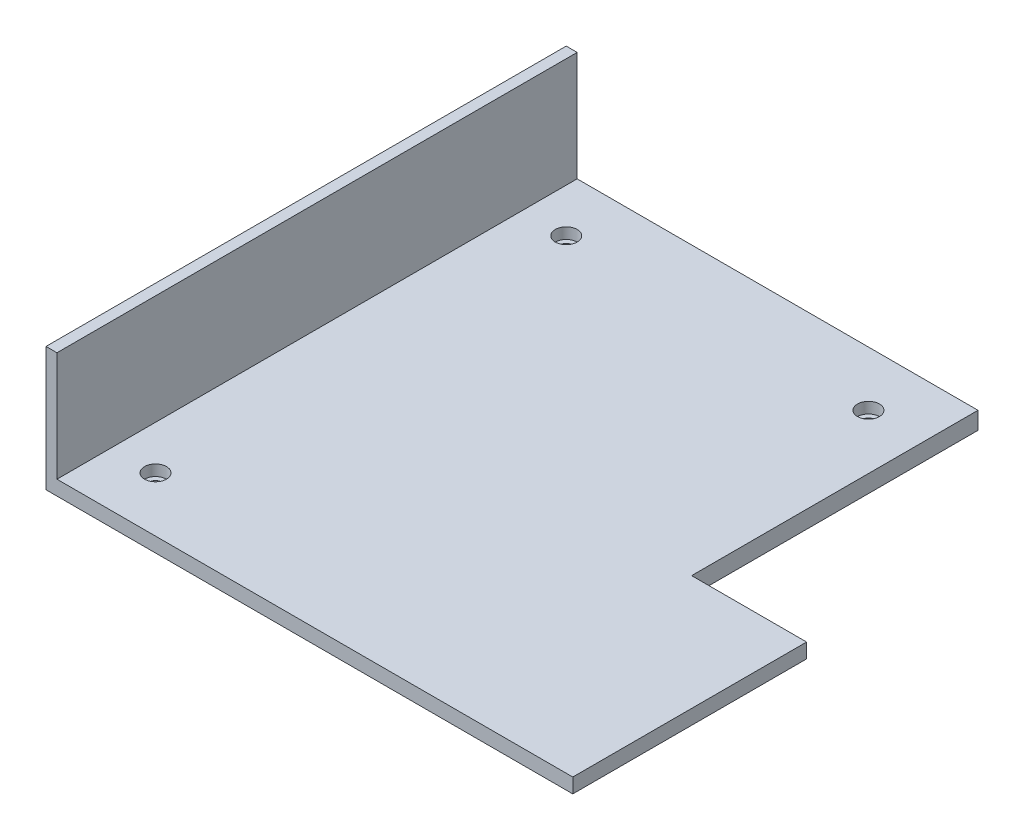
ISO-10303-21;
HEADER;
FILE_DESCRIPTION(('STEP AP214'),'2;1');
FILE_NAME('part.step','',(''),(''),'','','');
FILE_SCHEMA(('AUTOMOTIVE_DESIGN { 1 0 10303 214 1 1 1 1 }'));
ENDSEC;
DATA;
#1=APPLICATION_CONTEXT('core data for automotive mechanical design processes');
#2=APPLICATION_PROTOCOL_DEFINITION('international standard','automotive_design',2000,#1);
#3=PRODUCT_CONTEXT('',#1,'mechanical');
#4=PRODUCT('Part','Part','',(#3));
#5=PRODUCT_RELATED_PRODUCT_CATEGORY('part','',(#4));
#6=PRODUCT_DEFINITION_FORMATION('','',#4);
#7=PRODUCT_DEFINITION_CONTEXT('part definition',#1,'design');
#8=PRODUCT_DEFINITION('design','',#6,#7);
#9=PRODUCT_DEFINITION_SHAPE('','',#8);
#10=(LENGTH_UNIT() NAMED_UNIT(*) SI_UNIT(.MILLI.,.METRE.));
#11=(NAMED_UNIT(*) PLANE_ANGLE_UNIT() SI_UNIT($,.RADIAN.));
#12=(NAMED_UNIT(*) SI_UNIT($,.STERADIAN.) SOLID_ANGLE_UNIT());
#13=UNCERTAINTY_MEASURE_WITH_UNIT(LENGTH_MEASURE(1.E-05),#10,'distance_accuracy_value','');
#14=(GEOMETRIC_REPRESENTATION_CONTEXT(3) GLOBAL_UNCERTAINTY_ASSIGNED_CONTEXT((#13)) GLOBAL_UNIT_ASSIGNED_CONTEXT((#10,
#11,#12)) REPRESENTATION_CONTEXT('',''));
#15=CARTESIAN_POINT('',(0.,0.,0.));
#16=DIRECTION('',(0.,0.,1.));
#17=DIRECTION('',(1.,0.,0.));
#18=AXIS2_PLACEMENT_3D('',#15,#16,#17);
#19=CARTESIAN_POINT('',(96.2,6.35,-95.));
#20=DIRECTION('',(-1.,0.,0.));
#21=DIRECTION('',(0.,0.,1.));
#22=AXIS2_PLACEMENT_3D('',#19,#20,#21);
#23=PLANE('',#22);
#24=DIRECTION('',(0.,-1.,0.));
#25=VECTOR('',#24,1.);
#26=CARTESIAN_POINT('',(96.2,6.35,95.));
#27=LINE('',#26,#25);
#28=CARTESIAN_POINT('',(96.2,6.35,95.));
#29=VERTEX_POINT('',#28);
#30=CARTESIAN_POINT('',(96.2,1.,95.));
#31=VERTEX_POINT('',#30);
#32=EDGE_CURVE('E159',#29,#31,#27,.T.);
#33=ORIENTED_EDGE('',*,*,#32,.T.);
#34=DIRECTION('',(0.,0.,-1.));
#35=VECTOR('',#34,1.);
#36=CARTESIAN_POINT('',(96.2,1.,-95.));
#37=LINE('',#36,#35);
#38=CARTESIAN_POINT('',(96.2,1.,9.60000000000001));
#39=VERTEX_POINT('',#38);
#40=EDGE_CURVE('E181',#31,#39,#37,.T.);
#41=ORIENTED_EDGE('',*,*,#40,.T.);
#42=DIRECTION('',(0.,1.,0.));
#43=VECTOR('',#42,1.);
#44=CARTESIAN_POINT('',(96.2,-0.00100000000000013,9.60000000000001));
#45=LINE('',#44,#43);
#46=CARTESIAN_POINT('',(96.2,6.35,9.60000000000001));
#47=VERTEX_POINT('',#46);
#48=EDGE_CURVE('E213',#39,#47,#45,.T.);
#49=ORIENTED_EDGE('',*,*,#48,.T.);
#50=DIRECTION('',(0.,0.,-1.));
#51=VECTOR('',#50,1.);
#52=CARTESIAN_POINT('',(96.2,6.35,-95.));
#53=LINE('',#52,#51);
#54=EDGE_CURVE('E155',#29,#47,#53,.T.);
#55=ORIENTED_EDGE('',*,*,#54,.F.);
#56=EDGE_LOOP('',(#33,#41,#49,#55));
#57=FACE_BOUND('',#56,.T.);
#58=ADVANCED_FACE('F47',(#57),#23,.F.);
#59=CARTESIAN_POINT('',(-96.2,6.35,-95.));
#60=DIRECTION('',(0.,0.,1.));
#61=DIRECTION('',(1.,0.,0.));
#62=AXIS2_PLACEMENT_3D('',#59,#60,#61);
#63=PLANE('',#62);
#64=DIRECTION('',(-1.,0.,0.));
#65=VECTOR('',#64,1.);
#66=CARTESIAN_POINT('',(-96.2,6.35,-95.));
#67=LINE('',#66,#65);
#68=CARTESIAN_POINT('',(54.2,6.35,-95.));
#69=VERTEX_POINT('',#68);
#70=CARTESIAN_POINT('',(-92.2,6.35,-95.));
#71=VERTEX_POINT('',#70);
#72=EDGE_CURVE('E141',#69,#71,#67,.T.);
#73=ORIENTED_EDGE('',*,*,#72,.F.);
#74=DIRECTION('',(0.,1.,0.));
#75=VECTOR('',#74,1.);
#76=CARTESIAN_POINT('',(54.2,-0.00100000000000013,-95.));
#77=LINE('',#76,#75);
#78=CARTESIAN_POINT('',(54.2,0.,-95.));
#79=VERTEX_POINT('',#78);
#80=EDGE_CURVE('E124',#79,#69,#77,.T.);
#81=ORIENTED_EDGE('',*,*,#80,.F.);
#82=DIRECTION('',(-1.,0.,0.));
#83=VECTOR('',#82,1.);
#84=CARTESIAN_POINT('',(-96.2,0.,-95.));
#85=LINE('',#84,#83);
#86=CARTESIAN_POINT('',(-96.2,0.,-95.));
#87=VERTEX_POINT('',#86);
#88=EDGE_CURVE('E165',#79,#87,#85,.T.);
#89=ORIENTED_EDGE('',*,*,#88,.T.);
#90=DIRECTION('',(0.,-1.,0.));
#91=VECTOR('',#90,1.);
#92=CARTESIAN_POINT('',(-96.2,6.35,-95.));
#93=LINE('',#92,#91);
#94=CARTESIAN_POINT('',(-96.2,46.35,-95.));
#95=VERTEX_POINT('',#94);
#96=EDGE_CURVE('E177',#95,#87,#93,.T.);
#97=ORIENTED_EDGE('',*,*,#96,.F.);
#98=DIRECTION('',(-1.,0.,0.));
#99=VECTOR('',#98,1.);
#100=CARTESIAN_POINT('',(-92.2,46.35,-95.));
#101=LINE('',#100,#99);
#102=CARTESIAN_POINT('',(-92.2,46.35,-95.));
#103=VERTEX_POINT('',#102);
#104=EDGE_CURVE('E229',#103,#95,#101,.T.);
#105=ORIENTED_EDGE('',*,*,#104,.F.);
#106=DIRECTION('',(0.,-1.,0.));
#107=VECTOR('',#106,1.);
#108=CARTESIAN_POINT('',(-92.2,46.35,-95.));
#109=LINE('',#108,#107);
#110=EDGE_CURVE('E152',#103,#71,#109,.T.);
#111=ORIENTED_EDGE('',*,*,#110,.T.);
#112=EDGE_LOOP('',(#73,#81,#89,#97,#105,#111));
#113=FACE_BOUND('',#112,.T.);
#114=ADVANCED_FACE('F149',(#113),#63,.F.);
#115=CARTESIAN_POINT('',(-96.2,6.35,-95.));
#116=DIRECTION('',(1.,0.,0.));
#117=DIRECTION('',(0.,0.,-1.));
#118=AXIS2_PLACEMENT_3D('',#115,#116,#117);
#119=PLANE('',#118);
#120=DIRECTION('',(0.,0.,1.));
#121=VECTOR('',#120,1.);
#122=CARTESIAN_POINT('',(-96.2,0.,-95.));
#123=LINE('',#122,#121);
#124=CARTESIAN_POINT('',(-96.2,0.,94.));
#125=VERTEX_POINT('',#124);
#126=EDGE_CURVE('E161',#87,#125,#123,.T.);
#127=ORIENTED_EDGE('',*,*,#126,.T.);
#128=DIRECTION('',(0.,-0.707106781186548,-0.707106781186548));
#129=VECTOR('',#128,1.);
#130=CARTESIAN_POINT('',(-96.2,1.,95.));
#131=LINE('',#130,#129);
#132=CARTESIAN_POINT('',(-96.2,1.,95.));
#133=VERTEX_POINT('',#132);
#134=EDGE_CURVE('E11',#125,#133,#131,.F.);
#135=ORIENTED_EDGE('',*,*,#134,.T.);
#136=DIRECTION('',(0.,-1.,0.));
#137=VECTOR('',#136,1.);
#138=CARTESIAN_POINT('',(-96.2,6.35,95.));
#139=LINE('',#138,#137);
#140=CARTESIAN_POINT('',(-96.2,46.35,95.));
#141=VERTEX_POINT('',#140);
#142=EDGE_CURVE('E174',#141,#133,#139,.T.);
#143=ORIENTED_EDGE('',*,*,#142,.F.);
#144=DIRECTION('',(0.,0.,1.));
#145=VECTOR('',#144,1.);
#146=CARTESIAN_POINT('',(-96.2,46.35,-95.));
#147=LINE('',#146,#145);
#148=EDGE_CURVE('E233',#95,#141,#147,.T.);
#149=ORIENTED_EDGE('',*,*,#148,.F.);
#150=ORIENTED_EDGE('',*,*,#96,.T.);
#151=EDGE_LOOP('',(#127,#135,#143,#149,#150));
#152=FACE_BOUND('',#151,.T.);
#153=ADVANCED_FACE('F255',(#152),#119,.F.);
#154=CARTESIAN_POINT('',(-96.2,6.35,95.));
#155=DIRECTION('',(0.,0.,-1.));
#156=DIRECTION('',(-1.,0.,0.));
#157=AXIS2_PLACEMENT_3D('',#154,#155,#156);
#158=PLANE('',#157);
#159=ORIENTED_EDGE('',*,*,#142,.T.);
#160=DIRECTION('',(1.,0.,0.));
#161=VECTOR('',#160,1.);
#162=CARTESIAN_POINT('',(-96.2,1.,95.));
#163=LINE('',#162,#161);
#164=EDGE_CURVE('E58',#133,#31,#163,.T.);
#165=ORIENTED_EDGE('',*,*,#164,.T.);
#166=ORIENTED_EDGE('',*,*,#32,.F.);
#167=DIRECTION('',(1.,0.,0.));
#168=VECTOR('',#167,1.);
#169=CARTESIAN_POINT('',(-96.2,6.35,95.));
#170=LINE('',#169,#168);
#171=CARTESIAN_POINT('',(-92.2,6.35,95.));
#172=VERTEX_POINT('',#171);
#173=EDGE_CURVE('E154',#172,#29,#170,.T.);
#174=ORIENTED_EDGE('',*,*,#173,.F.);
#175=DIRECTION('',(0.,-1.,0.));
#176=VECTOR('',#175,1.);
#177=CARTESIAN_POINT('',(-92.2,46.35,95.));
#178=LINE('',#177,#176);
#179=CARTESIAN_POINT('',(-92.2,46.35,95.));
#180=VERTEX_POINT('',#179);
#181=EDGE_CURVE('E168',#180,#172,#178,.T.);
#182=ORIENTED_EDGE('',*,*,#181,.F.);
#183=DIRECTION('',(1.,0.,0.));
#184=VECTOR('',#183,1.);
#185=CARTESIAN_POINT('',(-92.2,46.35,95.));
#186=LINE('',#185,#184);
#187=EDGE_CURVE('E237',#141,#180,#186,.T.);
#188=ORIENTED_EDGE('',*,*,#187,.F.);
#189=EDGE_LOOP('',(#159,#165,#166,#174,#182,#188));
#190=FACE_BOUND('',#189,.T.);
#191=ADVANCED_FACE('F197',(#190),#158,.F.);
#192=CARTESIAN_POINT('',(0.,6.35,0.));
#193=DIRECTION('',(0.,1.,0.));
#194=DIRECTION('',(0.,0.,1.));
#195=AXIS2_PLACEMENT_3D('',#192,#193,#194);
#196=PLANE('',#195);
#197=CARTESIAN_POINT('',(-76.2,6.35,-75.));
#198=DIRECTION('',(0.,1.,0.));
#199=DIRECTION('',(0.,0.,1.));
#200=AXIS2_PLACEMENT_3D('',#197,#198,#199);
#201=CIRCLE('',#200,3.99999999999999);
#202=CARTESIAN_POINT('',(-76.2,6.35,-71.));
#203=VERTEX_POINT('',#202);
#204=EDGE_CURVE('E209',#203,#203,#201,.T.);
#205=ORIENTED_EDGE('',*,*,#204,.F.);
#206=EDGE_LOOP('',(#205));
#207=FACE_BOUND('',#206,.T.);
#208=CARTESIAN_POINT('',(-76.2,6.35,75.));
#209=DIRECTION('',(0.,1.,0.));
#210=DIRECTION('',(0.,0.,1.));
#211=AXIS2_PLACEMENT_3D('',#208,#209,#210);
#212=CIRCLE('',#211,3.99999999999999);
#213=CARTESIAN_POINT('',(-76.2,6.35,79.));
#214=VERTEX_POINT('',#213);
#215=EDGE_CURVE('E368',#214,#214,#212,.T.);
#216=ORIENTED_EDGE('',*,*,#215,.F.);
#217=EDGE_LOOP('',(#216));
#218=FACE_BOUND('',#217,.T.);
#219=CARTESIAN_POINT('',(34.2,6.35,-75.));
#220=DIRECTION('',(0.,1.,0.));
#221=DIRECTION('',(0.,0.,1.));
#222=AXIS2_PLACEMENT_3D('',#219,#220,#221);
#223=CIRCLE('',#222,3.99999999999999);
#224=CARTESIAN_POINT('',(34.2,6.35,-71.));
#225=VERTEX_POINT('',#224);
#226=EDGE_CURVE('E354',#225,#225,#223,.T.);
#227=ORIENTED_EDGE('',*,*,#226,.F.);
#228=EDGE_LOOP('',(#227));
#229=FACE_BOUND('',#228,.T.);
#230=DIRECTION('',(1.,0.,0.));
#231=VECTOR('',#230,1.);
#232=CARTESIAN_POINT('',(96.2,6.35,9.60000000000001));
#233=LINE('',#232,#231);
#234=CARTESIAN_POINT('',(54.2,6.35,9.60000000000002));
#235=VERTEX_POINT('',#234);
#236=EDGE_CURVE('E137',#235,#47,#233,.T.);
#237=ORIENTED_EDGE('',*,*,#236,.F.);
#238=DIRECTION('',(0.,0.,1.));
#239=VECTOR('',#238,1.);
#240=CARTESIAN_POINT('',(54.2,6.35,-95.));
#241=LINE('',#240,#239);
#242=EDGE_CURVE('E128',#69,#235,#241,.T.);
#243=ORIENTED_EDGE('',*,*,#242,.F.);
#244=ORIENTED_EDGE('',*,*,#72,.T.);
#245=DIRECTION('',(0.,0.,-1.));
#246=VECTOR('',#245,1.);
#247=CARTESIAN_POINT('',(-92.2,6.35,-91.));
#248=LINE('',#247,#246);
#249=EDGE_CURVE('E226',#172,#71,#248,.T.);
#250=ORIENTED_EDGE('',*,*,#249,.F.);
#251=ORIENTED_EDGE('',*,*,#173,.T.);
#252=ORIENTED_EDGE('',*,*,#54,.T.);
#253=EDGE_LOOP('',(#237,#243,#244,#250,#251,#252));
#254=FACE_BOUND('',#253,.T.);
#255=ADVANCED_FACE('F140',(#207,#218,#229,#254),#196,.T.);
#256=CARTESIAN_POINT('',(0.,0.,0.));
#257=DIRECTION('',(0.,1.,0.));
#258=DIRECTION('',(0.,0.,1.));
#259=AXIS2_PLACEMENT_3D('',#256,#257,#258);
#260=PLANE('',#259);
#261=CARTESIAN_POINT('',(-76.2,0.,-75.));
#262=DIRECTION('',(0.,1.,0.));
#263=DIRECTION('',(0.,0.,1.));
#264=AXIS2_PLACEMENT_3D('',#261,#262,#263);
#265=CIRCLE('',#264,2.25000000000001);
#266=CARTESIAN_POINT('',(-76.2,0.,-72.75));
#267=VERTEX_POINT('',#266);
#268=EDGE_CURVE('E337',#267,#267,#265,.T.);
#269=ORIENTED_EDGE('',*,*,#268,.T.);
#270=EDGE_LOOP('',(#269));
#271=FACE_BOUND('',#270,.T.);
#272=CARTESIAN_POINT('',(-76.2,0.,75.));
#273=DIRECTION('',(0.,1.,0.));
#274=DIRECTION('',(0.,0.,1.));
#275=AXIS2_PLACEMENT_3D('',#272,#273,#274);
#276=CIRCLE('',#275,2.25000000000001);
#277=CARTESIAN_POINT('',(-76.2,0.,77.25));
#278=VERTEX_POINT('',#277);
#279=EDGE_CURVE('E341',#278,#278,#276,.T.);
#280=ORIENTED_EDGE('',*,*,#279,.T.);
#281=EDGE_LOOP('',(#280));
#282=FACE_BOUND('',#281,.T.);
#283=CARTESIAN_POINT('',(34.2,0.,-75.));
#284=DIRECTION('',(0.,1.,0.));
#285=DIRECTION('',(0.,0.,1.));
#286=AXIS2_PLACEMENT_3D('',#283,#284,#285);
#287=CIRCLE('',#286,2.25000000000001);
#288=CARTESIAN_POINT('',(34.2,0.,-72.75));
#289=VERTEX_POINT('',#288);
#290=EDGE_CURVE('E218',#289,#289,#287,.T.);
#291=ORIENTED_EDGE('',*,*,#290,.T.);
#292=EDGE_LOOP('',(#291));
#293=FACE_BOUND('',#292,.T.);
#294=DIRECTION('',(-1.,0.,0.));
#295=VECTOR('',#294,1.);
#296=CARTESIAN_POINT('',(96.2,0.,9.60000000000001));
#297=LINE('',#296,#295);
#298=CARTESIAN_POINT('',(95.2,0.,9.60000000000001));
#299=VERTEX_POINT('',#298);
#300=CARTESIAN_POINT('',(54.2,0.,9.60000000000002));
#301=VERTEX_POINT('',#300);
#302=EDGE_CURVE('E146',#299,#301,#297,.T.);
#303=ORIENTED_EDGE('',*,*,#302,.F.);
#304=DIRECTION('',(0.,0.,1.));
#305=VECTOR('',#304,1.);
#306=CARTESIAN_POINT('',(95.2,0.,0.));
#307=LINE('',#306,#305);
#308=CARTESIAN_POINT('',(95.2,0.,94.));
#309=VERTEX_POINT('',#308);
#310=EDGE_CURVE('E71',#299,#309,#307,.T.);
#311=ORIENTED_EDGE('',*,*,#310,.T.);
#312=DIRECTION('',(-1.,0.,0.));
#313=VECTOR('',#312,1.);
#314=CARTESIAN_POINT('',(0.,0.,94.));
#315=LINE('',#314,#313);
#316=EDGE_CURVE('E188',#309,#125,#315,.T.);
#317=ORIENTED_EDGE('',*,*,#316,.T.);
#318=ORIENTED_EDGE('',*,*,#126,.F.);
#319=ORIENTED_EDGE('',*,*,#88,.F.);
#320=DIRECTION('',(0.,0.,-1.));
#321=VECTOR('',#320,1.);
#322=CARTESIAN_POINT('',(54.2,0.,-95.));
#323=LINE('',#322,#321);
#324=EDGE_CURVE('E131',#301,#79,#323,.T.);
#325=ORIENTED_EDGE('',*,*,#324,.F.);
#326=EDGE_LOOP('',(#303,#311,#317,#318,#319,#325));
#327=FACE_BOUND('',#326,.T.);
#328=ADVANCED_FACE('F214',(#271,#282,#293,#327),#260,.F.);
#329=CARTESIAN_POINT('',(-92.2,46.35,-91.));
#330=DIRECTION('',(-1.,0.,0.));
#331=DIRECTION('',(0.,0.,1.));
#332=AXIS2_PLACEMENT_3D('',#329,#330,#331);
#333=PLANE('',#332);
#334=ORIENTED_EDGE('',*,*,#249,.T.);
#335=ORIENTED_EDGE('',*,*,#110,.F.);
#336=DIRECTION('',(0.,0.,-1.));
#337=VECTOR('',#336,1.);
#338=CARTESIAN_POINT('',(-92.2,46.35,91.));
#339=LINE('',#338,#337);
#340=EDGE_CURVE('E240',#180,#103,#339,.T.);
#341=ORIENTED_EDGE('',*,*,#340,.F.);
#342=ORIENTED_EDGE('',*,*,#181,.T.);
#343=EDGE_LOOP('',(#334,#335,#341,#342));
#344=FACE_BOUND('',#343,.T.);
#345=ADVANCED_FACE('F251',(#344),#333,.F.);
#346=CARTESIAN_POINT('',(0.,46.35,0.));
#347=DIRECTION('',(0.,1.,0.));
#348=DIRECTION('',(0.,0.,1.));
#349=AXIS2_PLACEMENT_3D('',#346,#347,#348);
#350=PLANE('',#349);
#351=ORIENTED_EDGE('',*,*,#104,.T.);
#352=ORIENTED_EDGE('',*,*,#148,.T.);
#353=ORIENTED_EDGE('',*,*,#187,.T.);
#354=ORIENTED_EDGE('',*,*,#340,.T.);
#355=EDGE_LOOP('',(#351,#352,#353,#354));
#356=FACE_BOUND('',#355,.T.);
#357=ADVANCED_FACE('F253',(#356),#350,.T.);
#358=CARTESIAN_POINT('',(96.2,-0.00100000000000013,9.60000000000001));
#359=DIRECTION('',(0.,0.,1.));
#360=DIRECTION('',(1.,0.,0.));
#361=AXIS2_PLACEMENT_3D('',#358,#359,#360);
#362=PLANE('',#361);
#363=ORIENTED_EDGE('',*,*,#48,.F.);
#364=DIRECTION('',(0.707106781186548,0.707106781186548,0.));
#365=VECTOR('',#364,1.);
#366=CARTESIAN_POINT('',(96.2,1.,9.60000000000001));
#367=LINE('',#366,#365);
#368=EDGE_CURVE('E185',#39,#299,#367,.F.);
#369=ORIENTED_EDGE('',*,*,#368,.T.);
#370=ORIENTED_EDGE('',*,*,#302,.T.);
#371=DIRECTION('',(0.,1.,0.));
#372=VECTOR('',#371,1.);
#373=CARTESIAN_POINT('',(54.2,-0.00100000000000013,9.60000000000002));
#374=LINE('',#373,#372);
#375=EDGE_CURVE('E136',#301,#235,#374,.T.);
#376=ORIENTED_EDGE('',*,*,#375,.T.);
#377=ORIENTED_EDGE('',*,*,#236,.T.);
#378=EDGE_LOOP('',(#363,#369,#370,#376,#377));
#379=FACE_BOUND('',#378,.T.);
#380=ADVANCED_FACE('F212',(#379),#362,.F.);
#381=CARTESIAN_POINT('',(54.2,-0.00100000000000013,-95.));
#382=DIRECTION('',(-1.,0.,0.));
#383=DIRECTION('',(0.,0.,1.));
#384=AXIS2_PLACEMENT_3D('',#381,#382,#383);
#385=PLANE('',#384);
#386=ORIENTED_EDGE('',*,*,#324,.T.);
#387=ORIENTED_EDGE('',*,*,#80,.T.);
#388=ORIENTED_EDGE('',*,*,#242,.T.);
#389=ORIENTED_EDGE('',*,*,#375,.F.);
#390=EDGE_LOOP('',(#386,#387,#388,#389));
#391=FACE_BOUND('',#390,.T.);
#392=ADVANCED_FACE('F126',(#391),#385,.F.);
#393=CARTESIAN_POINT('',(34.2,6.35,-75.));
#394=DIRECTION('',(0.,1.,0.));
#395=DIRECTION('',(0.,0.,1.));
#396=AXIS2_PLACEMENT_3D('',#393,#394,#395);
#397=CYLINDRICAL_SURFACE('',#396,2.25000000000001);
#398=ORIENTED_EDGE('',*,*,#290,.F.);
#399=EDGE_LOOP('',(#398));
#400=FACE_BOUND('',#399,.T.);
#401=CARTESIAN_POINT('',(34.2,2.35,-75.));
#402=DIRECTION('',(0.,1.,0.));
#403=DIRECTION('',(0.,0.,1.));
#404=AXIS2_PLACEMENT_3D('',#401,#402,#403);
#405=CIRCLE('',#404,2.25000000000002);
#406=CARTESIAN_POINT('',(34.2,2.35,-72.75));
#407=VERTEX_POINT('',#406);
#408=EDGE_CURVE('E345',#407,#407,#405,.T.);
#409=ORIENTED_EDGE('',*,*,#408,.T.);
#410=EDGE_LOOP('',(#409));
#411=FACE_BOUND('',#410,.T.);
#412=ADVANCED_FACE('F315',(#400,#411),#397,.F.);
#413=CARTESIAN_POINT('',(36.45,2.35,-75.));
#414=DIRECTION('',(0.,-1.,0.));
#415=DIRECTION('',(0.,0.,-1.));
#416=AXIS2_PLACEMENT_3D('',#413,#414,#415);
#417=PLANE('',#416);
#418=ORIENTED_EDGE('',*,*,#408,.F.);
#419=EDGE_LOOP('',(#418));
#420=FACE_BOUND('',#419,.T.);
#421=CARTESIAN_POINT('',(34.2,2.35,-75.));
#422=DIRECTION('',(0.,1.,0.));
#423=DIRECTION('',(0.,0.,1.));
#424=AXIS2_PLACEMENT_3D('',#421,#422,#423);
#425=CIRCLE('',#424,3.99999999999999);
#426=CARTESIAN_POINT('',(34.2,2.35,-71.));
#427=VERTEX_POINT('',#426);
#428=EDGE_CURVE('E348',#427,#427,#425,.T.);
#429=ORIENTED_EDGE('',*,*,#428,.T.);
#430=EDGE_LOOP('',(#429));
#431=FACE_BOUND('',#430,.T.);
#432=ADVANCED_FACE('F311',(#420,#431),#417,.F.);
#433=CARTESIAN_POINT('',(34.2,6.35,-75.));
#434=DIRECTION('',(0.,1.,0.));
#435=DIRECTION('',(0.,0.,1.));
#436=AXIS2_PLACEMENT_3D('',#433,#434,#435);
#437=CYLINDRICAL_SURFACE('',#436,3.99999999999999);
#438=ORIENTED_EDGE('',*,*,#428,.F.);
#439=EDGE_LOOP('',(#438));
#440=FACE_BOUND('',#439,.T.);
#441=ORIENTED_EDGE('',*,*,#226,.T.);
#442=EDGE_LOOP('',(#441));
#443=FACE_BOUND('',#442,.T.);
#444=ADVANCED_FACE('F307',(#440,#443),#437,.F.);
#445=CARTESIAN_POINT('',(-76.2,6.35,75.));
#446=DIRECTION('',(0.,1.,0.));
#447=DIRECTION('',(0.,0.,1.));
#448=AXIS2_PLACEMENT_3D('',#445,#446,#447);
#449=CYLINDRICAL_SURFACE('',#448,2.25000000000001);
#450=ORIENTED_EDGE('',*,*,#279,.F.);
#451=EDGE_LOOP('',(#450));
#452=FACE_BOUND('',#451,.T.);
#453=CARTESIAN_POINT('',(-76.2,2.35,75.));
#454=DIRECTION('',(0.,1.,0.));
#455=DIRECTION('',(0.,0.,1.));
#456=AXIS2_PLACEMENT_3D('',#453,#454,#455);
#457=CIRCLE('',#456,2.25000000000002);
#458=CARTESIAN_POINT('',(-76.2,2.35,77.25));
#459=VERTEX_POINT('',#458);
#460=EDGE_CURVE('E360',#459,#459,#457,.T.);
#461=ORIENTED_EDGE('',*,*,#460,.T.);
#462=EDGE_LOOP('',(#461));
#463=FACE_BOUND('',#462,.T.);
#464=ADVANCED_FACE('F303',(#452,#463),#449,.F.);
#465=CARTESIAN_POINT('',(-73.95,2.35,75.));
#466=DIRECTION('',(0.,-1.,0.));
#467=DIRECTION('',(0.,0.,-1.));
#468=AXIS2_PLACEMENT_3D('',#465,#466,#467);
#469=PLANE('',#468);
#470=ORIENTED_EDGE('',*,*,#460,.F.);
#471=EDGE_LOOP('',(#470));
#472=FACE_BOUND('',#471,.T.);
#473=CARTESIAN_POINT('',(-76.2,2.35,75.));
#474=DIRECTION('',(0.,1.,0.));
#475=DIRECTION('',(0.,0.,1.));
#476=AXIS2_PLACEMENT_3D('',#473,#474,#475);
#477=CIRCLE('',#476,3.99999999999999);
#478=CARTESIAN_POINT('',(-76.2,2.35,79.));
#479=VERTEX_POINT('',#478);
#480=EDGE_CURVE('E364',#479,#479,#477,.T.);
#481=ORIENTED_EDGE('',*,*,#480,.T.);
#482=EDGE_LOOP('',(#481));
#483=FACE_BOUND('',#482,.T.);
#484=ADVANCED_FACE('F299',(#472,#483),#469,.F.);
#485=CARTESIAN_POINT('',(-76.2,6.35,75.));
#486=DIRECTION('',(0.,1.,0.));
#487=DIRECTION('',(0.,0.,1.));
#488=AXIS2_PLACEMENT_3D('',#485,#486,#487);
#489=CYLINDRICAL_SURFACE('',#488,3.99999999999999);
#490=ORIENTED_EDGE('',*,*,#480,.F.);
#491=EDGE_LOOP('',(#490));
#492=FACE_BOUND('',#491,.T.);
#493=ORIENTED_EDGE('',*,*,#215,.T.);
#494=EDGE_LOOP('',(#493));
#495=FACE_BOUND('',#494,.T.);
#496=ADVANCED_FACE('F295',(#492,#495),#489,.F.);
#497=CARTESIAN_POINT('',(-76.2,6.35,-75.));
#498=DIRECTION('',(0.,1.,0.));
#499=DIRECTION('',(0.,0.,1.));
#500=AXIS2_PLACEMENT_3D('',#497,#498,#499);
#501=CYLINDRICAL_SURFACE('',#500,2.25000000000001);
#502=ORIENTED_EDGE('',*,*,#268,.F.);
#503=EDGE_LOOP('',(#502));
#504=FACE_BOUND('',#503,.T.);
#505=CARTESIAN_POINT('',(-76.2,2.35,-75.));
#506=DIRECTION('',(0.,1.,0.));
#507=DIRECTION('',(0.,0.,1.));
#508=AXIS2_PLACEMENT_3D('',#505,#506,#507);
#509=CIRCLE('',#508,2.25000000000002);
#510=CARTESIAN_POINT('',(-76.2,2.35,-72.75));
#511=VERTEX_POINT('',#510);
#512=EDGE_CURVE('E374',#511,#511,#509,.T.);
#513=ORIENTED_EDGE('',*,*,#512,.T.);
#514=EDGE_LOOP('',(#513));
#515=FACE_BOUND('',#514,.T.);
#516=ADVANCED_FACE('F287',(#504,#515),#501,.F.);
#517=CARTESIAN_POINT('',(-73.95,2.35,-75.));
#518=DIRECTION('',(0.,-1.,0.));
#519=DIRECTION('',(0.,0.,-1.));
#520=AXIS2_PLACEMENT_3D('',#517,#518,#519);
#521=PLANE('',#520);
#522=ORIENTED_EDGE('',*,*,#512,.F.);
#523=EDGE_LOOP('',(#522));
#524=FACE_BOUND('',#523,.T.);
#525=CARTESIAN_POINT('',(-76.2,2.35,-75.));
#526=DIRECTION('',(0.,1.,0.));
#527=DIRECTION('',(0.,0.,1.));
#528=AXIS2_PLACEMENT_3D('',#525,#526,#527);
#529=CIRCLE('',#528,3.99999999999999);
#530=CARTESIAN_POINT('',(-76.2,2.35,-71.));
#531=VERTEX_POINT('',#530);
#532=EDGE_CURVE('E378',#531,#531,#529,.T.);
#533=ORIENTED_EDGE('',*,*,#532,.T.);
#534=EDGE_LOOP('',(#533));
#535=FACE_BOUND('',#534,.T.);
#536=ADVANCED_FACE('F281',(#524,#535),#521,.F.);
#537=CARTESIAN_POINT('',(-76.2,6.35,-75.));
#538=DIRECTION('',(0.,1.,0.));
#539=DIRECTION('',(0.,0.,1.));
#540=AXIS2_PLACEMENT_3D('',#537,#538,#539);
#541=CYLINDRICAL_SURFACE('',#540,3.99999999999999);
#542=ORIENTED_EDGE('',*,*,#532,.F.);
#543=EDGE_LOOP('',(#542));
#544=FACE_BOUND('',#543,.T.);
#545=ORIENTED_EDGE('',*,*,#204,.T.);
#546=EDGE_LOOP('',(#545));
#547=FACE_BOUND('',#546,.T.);
#548=ADVANCED_FACE('F277',(#544,#547),#541,.F.);
#549=CARTESIAN_POINT('',(-96.2,1.,95.));
#550=DIRECTION('',(0.,0.707106781186547,-0.707106781186547));
#551=DIRECTION('',(1.,0.,0.));
#552=AXIS2_PLACEMENT_3D('',#549,#550,#551);
#553=PLANE('',#552);
#554=ORIENTED_EDGE('',*,*,#134,.F.);
#555=ORIENTED_EDGE('',*,*,#316,.F.);
#556=DIRECTION('',(0.577350269189626,0.577350269189626,0.577350269189626));
#557=VECTOR('',#556,1.);
#558=CARTESIAN_POINT('',(32.0666666666667,-63.1333333333334,30.8666666666667));
#559=LINE('',#558,#557);
#560=EDGE_CURVE('E52',#31,#309,#559,.F.);
#561=ORIENTED_EDGE('',*,*,#560,.F.);
#562=ORIENTED_EDGE('',*,*,#164,.F.);
#563=EDGE_LOOP('',(#554,#555,#561,#562));
#564=FACE_BOUND('',#563,.T.);
#565=ADVANCED_FACE('F50',(#564),#553,.F.);
#566=CARTESIAN_POINT('',(96.2,1.,-95.));
#567=DIRECTION('',(-0.707106781186547,0.707106781186547,0.));
#568=DIRECTION('',(0.,0.,-1.));
#569=AXIS2_PLACEMENT_3D('',#566,#567,#568);
#570=PLANE('',#569);
#571=ORIENTED_EDGE('',*,*,#560,.T.);
#572=ORIENTED_EDGE('',*,*,#310,.F.);
#573=ORIENTED_EDGE('',*,*,#368,.F.);
#574=ORIENTED_EDGE('',*,*,#40,.F.);
#575=EDGE_LOOP('',(#571,#572,#573,#574));
#576=FACE_BOUND('',#575,.T.);
#577=ADVANCED_FACE('F210',(#576),#570,.F.);
#578=CLOSED_SHELL('',(#58,#114,#153,#191,#255,#328,#345,#357,#380,#392,#412,#432,#444,#464,#484,
#496,#516,#536,#548,#565,#577));
#579=MANIFOLD_SOLID_BREP('B2',#578);
#580=ADVANCED_BREP_SHAPE_REPRESENTATION('',(#18,#579),#14);
#581=SHAPE_DEFINITION_REPRESENTATION(#9,#580);
ENDSEC;
END-ISO-10303-21;
